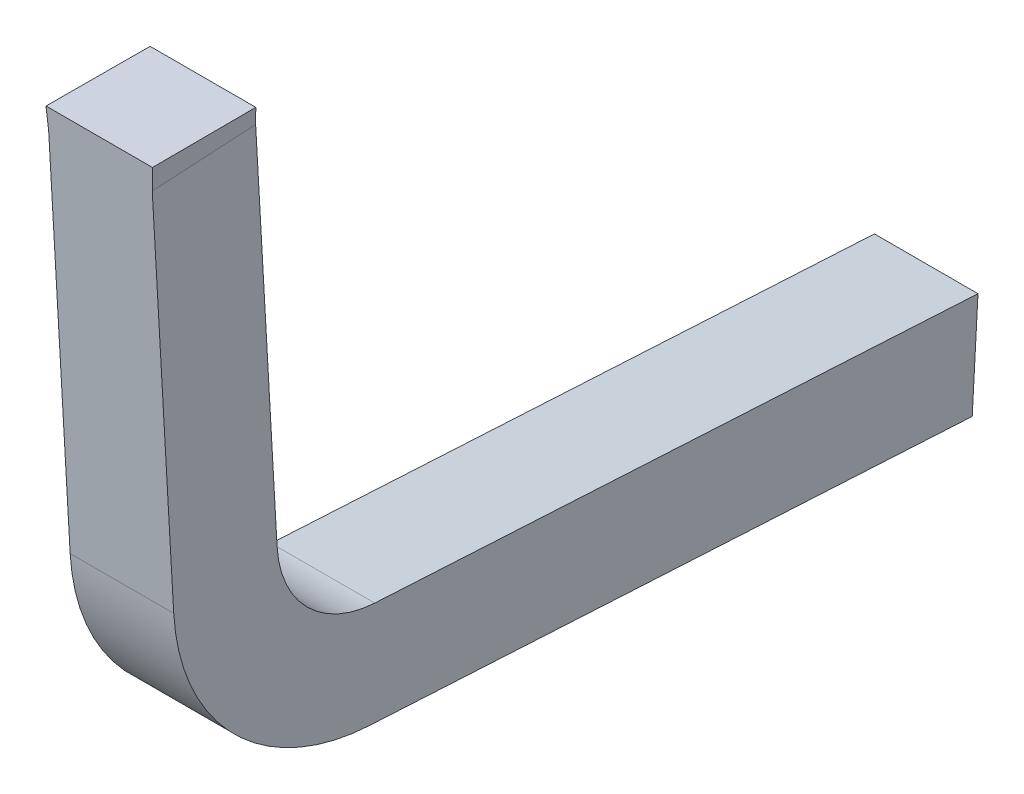
ISO-10303-21;
HEADER;
FILE_DESCRIPTION(('STEP AP214'),'2;1');
FILE_NAME('part.step','',(''),(''),'','','');
FILE_SCHEMA(('AUTOMOTIVE_DESIGN { 1 0 10303 214 1 1 1 1 }'));
ENDSEC;
DATA;
#1=APPLICATION_CONTEXT('core data for automotive mechanical design processes');
#2=APPLICATION_PROTOCOL_DEFINITION('international standard','automotive_design',2000,#1);
#3=PRODUCT_CONTEXT('',#1,'mechanical');
#4=PRODUCT('Part','Part','',(#3));
#5=PRODUCT_RELATED_PRODUCT_CATEGORY('part','',(#4));
#6=PRODUCT_DEFINITION_FORMATION('','',#4);
#7=PRODUCT_DEFINITION_CONTEXT('part definition',#1,'design');
#8=PRODUCT_DEFINITION('design','',#6,#7);
#9=PRODUCT_DEFINITION_SHAPE('','',#8);
#10=(LENGTH_UNIT() NAMED_UNIT(*) SI_UNIT(.MILLI.,.METRE.));
#11=(NAMED_UNIT(*) PLANE_ANGLE_UNIT() SI_UNIT($,.RADIAN.));
#12=(NAMED_UNIT(*) SI_UNIT($,.STERADIAN.) SOLID_ANGLE_UNIT());
#13=UNCERTAINTY_MEASURE_WITH_UNIT(LENGTH_MEASURE(1.E-05),#10,'distance_accuracy_value','');
#14=(GEOMETRIC_REPRESENTATION_CONTEXT(3) GLOBAL_UNCERTAINTY_ASSIGNED_CONTEXT((#13)) GLOBAL_UNIT_ASSIGNED_CONTEXT((#10,
#11,#12)) REPRESENTATION_CONTEXT('',''));
#15=CARTESIAN_POINT('',(0.,0.,0.));
#16=DIRECTION('',(0.,0.,1.));
#17=DIRECTION('',(1.,0.,0.));
#18=AXIS2_PLACEMENT_3D('',#15,#16,#17);
#19=CARTESIAN_POINT('',(-2.601406834182,-2.29897527843,-10.34781984343));
#20=DIRECTION('',(0.997785157857701,0.0664110878974701,0.003787632922693));
#21=DIRECTION('',(-0.0664115642747469,0.997792315129046,0.));
#22=AXIS2_PLACEMENT_3D('',#19,#20,#21);
#23=PLANE('',#22);
#24=DIRECTION('',(0.,-0.0569406083110753,0.998377567418842));
#25=VECTOR('',#24,1.);
#26=CARTESIAN_POINT('',(-2.6,-2.314349492935,-10.44885919008));
#27=LINE('',#26,#25);
#28=CARTESIAN_POINT('',(-2.6,-2.31434949293492,-10.4488591900814));
#29=VERTEX_POINT('',#28);
#30=CARTESIAN_POINT('',(-2.6,-2.32573761459728,-10.2491836765951));
#31=VERTEX_POINT('',#30);
#32=EDGE_CURVE('E98',#29,#31,#27,.T.);
#33=ORIENTED_EDGE('',*,*,#32,.T.);
#34=DIRECTION('',(0.0665190105147783,-0.996166318707982,-0.056814493854309));
#35=VECTOR('',#34,1.);
#36=CARTESIAN_POINT('',(-2.602813668365,-2.28360106392498,-10.2467804967704));
#37=LINE('',#36,#35);
#38=CARTESIAN_POINT('',(-2.602813668365,-2.28360106392499,-10.2467804967704));
#39=VERTEX_POINT('',#38);
#40=EDGE_CURVE('E148',#39,#31,#37,.T.);
#41=ORIENTED_EDGE('',*,*,#40,.F.);
#42=DIRECTION('',(-0.00379601320157547,0.,0.999992795115932));
#43=VECTOR('',#42,1.);
#44=CARTESIAN_POINT('',(-2.602053226489,-2.283601063925,-10.4471055106));
#45=LINE('',#44,#43);
#46=CARTESIAN_POINT('',(-2.602053226489,-2.28360106392489,-10.4471055106019));
#47=VERTEX_POINT('',#46);
#48=EDGE_CURVE('E161',#47,#39,#45,.T.);
#49=ORIENTED_EDGE('',*,*,#48,.F.);
#50=DIRECTION('',(0.0665190105273673,-0.996166318707226,-0.0568144938528306));
#51=VECTOR('',#50,1.);
#52=CARTESIAN_POINT('',(-2.602053226489,-2.28360106392483,-10.4471055106029));
#53=LINE('',#52,#51);
#54=EDGE_CURVE('E103',#47,#29,#53,.T.);
#55=ORIENTED_EDGE('',*,*,#54,.T.);
#56=EDGE_LOOP('',(#33,#41,#49,#55));
#57=FACE_BOUND('',#56,.T.);
#58=ADVANCED_FACE('F17',(#57),#23,.F.);
#59=CARTESIAN_POINT('',(-2.5,-2.283601063925,-10.34694300369));
#60=DIRECTION('',(0.,1.,0.));
#61=DIRECTION('',(0.,0.,1.));
#62=AXIS2_PLACEMENT_3D('',#59,#60,#61);
#63=PLANE('',#62);
#64=DIRECTION('',(1.,0.,0.));
#65=VECTOR('',#64,1.);
#66=CARTESIAN_POINT('',(-2.5,-2.28360106392498,-10.2467804967704));
#67=LINE('',#66,#65);
#68=CARTESIAN_POINT('',(-2.39718633163476,-2.283601063925,-10.2467804967704));
#69=VERTEX_POINT('',#68);
#70=EDGE_CURVE('E154',#69,#39,#67,.F.);
#71=ORIENTED_EDGE('',*,*,#70,.F.);
#72=DIRECTION('',(0.0037960132042621,-1.7968426456006E-13,0.999992795115921));
#73=VECTOR('',#72,1.);
#74=CARTESIAN_POINT('',(-2.3979467735108,-2.28360106392501,-10.4471055106));
#75=LINE('',#74,#73);
#76=CARTESIAN_POINT('',(-2.39794677351087,-2.28360106392495,-10.447105510601));
#77=VERTEX_POINT('',#76);
#78=EDGE_CURVE('E119',#77,#69,#75,.T.);
#79=ORIENTED_EDGE('',*,*,#78,.F.);
#80=DIRECTION('',(1.,0.,0.));
#81=VECTOR('',#80,1.);
#82=CARTESIAN_POINT('',(-2.5,-2.28360106392483,-10.4471055106029));
#83=LINE('',#82,#81);
#84=EDGE_CURVE('E125',#77,#47,#83,.F.);
#85=ORIENTED_EDGE('',*,*,#84,.T.);
#86=ORIENTED_EDGE('',*,*,#48,.T.);
#87=EDGE_LOOP('',(#71,#79,#85,#86));
#88=FACE_BOUND('',#87,.T.);
#89=ADVANCED_FACE('F243',(#88),#63,.T.);
#90=CARTESIAN_POINT('',(-2.6,-2.909472777839,-11.05227927458));
#91=DIRECTION('',(1.,0.,0.));
#92=DIRECTION('',(0.,0.,-1.));
#93=AXIS2_PLACEMENT_3D('',#90,#91,#92);
#94=PLANE('',#93);
#95=CARTESIAN_POINT('',(-2.6,-3.03,-10.69));
#96=DIRECTION('',(-1.,0.,0.));
#97=DIRECTION('',(0.,0.,1.));
#98=AXIS2_PLACEMENT_3D('',#95,#96,#97);
#99=CIRCLE('',#98,0.4);
#100=CARTESIAN_POINT('',(-2.6,-3.05277624331319,-10.2906489730306));
#101=VERTEX_POINT('',#100);
#102=CARTESIAN_POINT('',(-2.6,-3.42937693582933,-10.6676826720305));
#103=VERTEX_POINT('',#102);
#104=EDGE_CURVE('E142',#101,#103,#99,.F.);
#105=ORIENTED_EDGE('',*,*,#104,.F.);
#106=DIRECTION('',(0.,-0.998377567418718,-0.056940608313261));
#107=VECTOR('',#106,1.);
#108=CARTESIAN_POINT('',(-2.6,-2.668188653621,-10.2687147349));
#109=LINE('',#108,#107);
#110=EDGE_CURVE('E145',#31,#101,#109,.T.);
#111=ORIENTED_EDGE('',*,*,#110,.F.);
#112=ORIENTED_EDGE('',*,*,#32,.F.);
#113=DIRECTION('',(0.,-0.998377567418801,-0.0569406083117901));
#114=VECTOR('',#113,1.);
#115=CARTESIAN_POINT('',(-2.6,-2.662494592804,-10.46871499856));
#116=LINE('',#115,#114);
#117=CARTESIAN_POINT('',(-2.6,-3.04138812167726,-10.4903244865168));
#118=VERTEX_POINT('',#117);
#119=EDGE_CURVE('E92',#29,#118,#116,.T.);
#120=ORIENTED_EDGE('',*,*,#119,.T.);
#121=CARTESIAN_POINT('',(-2.6,-3.03,-10.69));
#122=DIRECTION('',(-1.,0.,0.));
#123=DIRECTION('',(0.,0.,1.));
#124=AXIS2_PLACEMENT_3D('',#121,#122,#123);
#125=CIRCLE('',#124,0.2);
#126=CARTESIAN_POINT('',(-2.6,-3.22968846791482,-10.6788413360177));
#127=VERTEX_POINT('',#126);
#128=EDGE_CURVE('E20',#118,#127,#125,.F.);
#129=ORIENTED_EDGE('',*,*,#128,.T.);
#130=DIRECTION('',(0.,0.0557933199228295,0.998442339572991));
#131=VECTOR('',#130,1.);
#132=CARTESIAN_POINT('',(-2.6,-3.262244863925,-11.26145022621));
#133=LINE('',#132,#131);
#134=CARTESIAN_POINT('',(-2.6,-3.29480125993501,-11.8440591164004));
#135=VERTEX_POINT('',#134);
#136=EDGE_CURVE('E111',#135,#127,#133,.T.);
#137=ORIENTED_EDGE('',*,*,#136,.F.);
#138=DIRECTION('',(0.,-0.998442339574031,0.0557933199042218));
#139=VECTOR('',#138,1.);
#140=CARTESIAN_POINT('',(-2.6,-3.394645493892,-11.83847978441));
#141=LINE('',#140,#139);
#142=CARTESIAN_POINT('',(-2.6,-3.49448972784906,-11.8329004524196));
#143=VERTEX_POINT('',#142);
#144=EDGE_CURVE('E135',#135,#143,#141,.T.);
#145=ORIENTED_EDGE('',*,*,#144,.T.);
#146=DIRECTION('',(0.,0.055793319922371,0.998442339573017));
#147=VECTOR('',#146,1.);
#148=CARTESIAN_POINT('',(-2.6,-3.461933331839,-11.25029156222));
#149=LINE('',#148,#147);
#150=EDGE_CURVE('E140',#143,#103,#149,.T.);
#151=ORIENTED_EDGE('',*,*,#150,.T.);
#152=EDGE_LOOP('',(#105,#111,#112,#120,#129,#137,#145,#151));
#153=FACE_BOUND('',#152,.T.);
#154=ADVANCED_FACE('F95',(#153),#94,.F.);
#155=CARTESIAN_POINT('',(-2.5,-3.262244863925,-11.26145022621));
#156=DIRECTION('',(0.,0.998442339572991,-0.0557933199228295));
#157=DIRECTION('',(0.,0.0557933199228295,0.998442339572991));
#158=AXIS2_PLACEMENT_3D('',#155,#156,#157);
#159=PLANE('',#158);
#160=DIRECTION('',(0.,0.055793319922887,0.998442339572988));
#161=VECTOR('',#160,1.);
#162=CARTESIAN_POINT('',(-2.4,-3.294801259935,-11.8440591164));
#163=LINE('',#162,#161);
#164=CARTESIAN_POINT('',(-2.4,-3.29480125993501,-11.8440591164001));
#165=VERTEX_POINT('',#164);
#166=CARTESIAN_POINT('',(-2.4,-3.2296884679148,-10.6788413360177));
#167=VERTEX_POINT('',#166);
#168=EDGE_CURVE('E129',#165,#167,#163,.T.);
#169=ORIENTED_EDGE('',*,*,#168,.F.);
#170=DIRECTION('',(1.,0.,0.));
#171=VECTOR('',#170,1.);
#172=CARTESIAN_POINT('',(-2.5,-3.29480125993502,-11.8440591164004));
#173=LINE('',#172,#171);
#174=EDGE_CURVE('E126',#165,#135,#173,.F.);
#175=ORIENTED_EDGE('',*,*,#174,.T.);
#176=ORIENTED_EDGE('',*,*,#136,.T.);
#177=DIRECTION('',(-1.,0.,0.));
#178=VECTOR('',#177,1.);
#179=CARTESIAN_POINT('',(-2.396,-3.22968846791485,-10.67884133602));
#180=LINE('',#179,#178);
#181=EDGE_CURVE('E110',#127,#167,#180,.F.);
#182=ORIENTED_EDGE('',*,*,#181,.T.);
#183=EDGE_LOOP('',(#169,#175,#176,#182));
#184=FACE_BOUND('',#183,.T.);
#185=ADVANCED_FACE('F234',(#184),#159,.T.);
#186=CARTESIAN_POINT('',(-2.396,-3.03,-10.69));
#187=DIRECTION('',(-1.,0.,0.));
#188=DIRECTION('',(0.,0.,1.));
#189=AXIS2_PLACEMENT_3D('',#186,#187,#188);
#190=CYLINDRICAL_SURFACE('',#189,0.2);
#191=ORIENTED_EDGE('',*,*,#128,.F.);
#192=DIRECTION('',(1.,0.,0.));
#193=VECTOR('',#192,1.);
#194=CARTESIAN_POINT('',(-2.5,-3.04138812169214,-10.4903244865176));
#195=LINE('',#194,#193);
#196=CARTESIAN_POINT('',(-2.4,-3.04138812167779,-10.490324486518));
#197=VERTEX_POINT('',#196);
#198=EDGE_CURVE('E102',#118,#197,#195,.T.);
#199=ORIENTED_EDGE('',*,*,#198,.T.);
#200=CARTESIAN_POINT('',(-2.4,-3.03,-10.69));
#201=DIRECTION('',(-1.,0.,0.));
#202=DIRECTION('',(0.,0.,1.));
#203=AXIS2_PLACEMENT_3D('',#200,#201,#202);
#204=CIRCLE('',#203,0.2);
#205=EDGE_CURVE('E185',#167,#197,#204,.T.);
#206=ORIENTED_EDGE('',*,*,#205,.F.);
#207=ORIENTED_EDGE('',*,*,#181,.F.);
#208=EDGE_LOOP('',(#191,#199,#206,#207));
#209=FACE_BOUND('',#208,.T.);
#210=ADVANCED_FACE('F107',(#209),#190,.F.);
#211=CARTESIAN_POINT('',(-2.5,-2.662494592804,-10.46871499856));
#212=DIRECTION('',(0.,-0.0569406083117901,0.998377567418801));
#213=DIRECTION('',(0.,-0.998377567418801,-0.0569406083117901));
#214=AXIS2_PLACEMENT_3D('',#211,#212,#213);
#215=PLANE('',#214);
#216=DIRECTION('',(0.,0.998377567418456,0.0569406083178453));
#217=VECTOR('',#216,1.);
#218=CARTESIAN_POINT('',(-2.4,-3.041388121692,-10.49032448652));
#219=LINE('',#218,#217);
#220=CARTESIAN_POINT('',(-2.39999999999992,-2.314349492934,-10.44885919008));
#221=VERTEX_POINT('',#220);
#222=EDGE_CURVE('E114',#197,#221,#219,.T.);
#223=ORIENTED_EDGE('',*,*,#222,.F.);
#224=ORIENTED_EDGE('',*,*,#198,.F.);
#225=ORIENTED_EDGE('',*,*,#119,.F.);
#226=ORIENTED_EDGE('',*,*,#54,.F.);
#227=ORIENTED_EDGE('',*,*,#84,.F.);
#228=DIRECTION('',(0.0665190105284185,0.996166318705548,0.0568144938810224));
#229=VECTOR('',#228,1.);
#230=CARTESIAN_POINT('',(-2.39999999999977,-2.31434949293401,-10.44885919008));
#231=LINE('',#230,#229);
#232=EDGE_CURVE('E116',#221,#77,#231,.T.);
#233=ORIENTED_EDGE('',*,*,#232,.F.);
#234=EDGE_LOOP('',(#223,#224,#225,#226,#227,#233));
#235=FACE_BOUND('',#234,.T.);
#236=ADVANCED_FACE('F112',(#235),#215,.F.);
#237=CARTESIAN_POINT('',(-2.398593165817,-2.298975278429,-10.34781984343));
#238=DIRECTION('',(0.9977851578563,-0.06641108791847,-0.003787632923708));
#239=DIRECTION('',(0.0664115642957472,0.997792315127648,0.));
#240=AXIS2_PLACEMENT_3D('',#237,#238,#239);
#241=PLANE('',#240);
#242=ORIENTED_EDGE('',*,*,#232,.T.);
#243=ORIENTED_EDGE('',*,*,#78,.T.);
#244=DIRECTION('',(0.0665190105179116,0.996166318707773,0.0568144938543194));
#245=VECTOR('',#244,1.);
#246=CARTESIAN_POINT('',(-2.4,-2.32573761459528,-10.249183676595));
#247=LINE('',#246,#245);
#248=CARTESIAN_POINT('',(-2.4,-2.32573761459509,-10.2491836765983));
#249=VERTEX_POINT('',#248);
#250=EDGE_CURVE('E147',#249,#69,#247,.T.);
#251=ORIENTED_EDGE('',*,*,#250,.F.);
#252=DIRECTION('',(0.,-0.0569406083060912,0.998377567419126));
#253=VECTOR('',#252,1.);
#254=CARTESIAN_POINT('',(-2.4,-2.314349492934,-10.44885919008));
#255=LINE('',#254,#253);
#256=EDGE_CURVE('E200',#221,#249,#255,.T.);
#257=ORIENTED_EDGE('',*,*,#256,.F.);
#258=EDGE_LOOP('',(#242,#243,#251,#257));
#259=FACE_BOUND('',#258,.T.);
#260=ADVANCED_FACE('F258',(#259),#241,.T.);
#261=CARTESIAN_POINT('',(-2.5,-2.668188653621,-10.2687147349));
#262=DIRECTION('',(0.,-0.056940608313261,0.998377567418718));
#263=DIRECTION('',(0.,-0.998377567418718,-0.056940608313261));
#264=AXIS2_PLACEMENT_3D('',#261,#262,#263);
#265=PLANE('',#264);
#266=ORIENTED_EDGE('',*,*,#250,.T.);
#267=ORIENTED_EDGE('',*,*,#70,.T.);
#268=ORIENTED_EDGE('',*,*,#40,.T.);
#269=ORIENTED_EDGE('',*,*,#110,.T.);
#270=DIRECTION('',(-1.,0.,0.));
#271=VECTOR('',#270,1.);
#272=CARTESIAN_POINT('',(-2.396,-3.05277624330094,-10.2906489730311));
#273=LINE('',#272,#271);
#274=CARTESIAN_POINT('',(-2.4,-3.05277624331214,-10.2906489730312));
#275=VERTEX_POINT('',#274);
#276=EDGE_CURVE('E157',#275,#101,#273,.T.);
#277=ORIENTED_EDGE('',*,*,#276,.F.);
#278=DIRECTION('',(0.,-0.998377567419005,-0.0569406083082185));
#279=VECTOR('',#278,1.);
#280=CARTESIAN_POINT('',(-2.4,-2.325737614595,-10.2491836766));
#281=LINE('',#280,#279);
#282=EDGE_CURVE('E184',#249,#275,#281,.T.);
#283=ORIENTED_EDGE('',*,*,#282,.F.);
#284=EDGE_LOOP('',(#266,#267,#268,#269,#277,#283));
#285=FACE_BOUND('',#284,.T.);
#286=ADVANCED_FACE('F227',(#285),#265,.T.);
#287=CARTESIAN_POINT('',(-2.396,-3.03,-10.69));
#288=DIRECTION('',(-1.,0.,0.));
#289=DIRECTION('',(0.,0.,1.));
#290=AXIS2_PLACEMENT_3D('',#287,#288,#289);
#291=CYLINDRICAL_SURFACE('',#290,0.4);
#292=DIRECTION('',(1.,0.,0.));
#293=VECTOR('',#292,1.);
#294=CARTESIAN_POINT('',(-2.5,-3.4293769358293,-10.66768267203));
#295=LINE('',#294,#293);
#296=CARTESIAN_POINT('',(-2.4,-3.42937693582946,-10.6676826720306));
#297=VERTEX_POINT('',#296);
#298=EDGE_CURVE('E137',#103,#297,#295,.T.);
#299=ORIENTED_EDGE('',*,*,#298,.T.);
#300=CARTESIAN_POINT('',(-2.4,-3.03,-10.69));
#301=DIRECTION('',(-1.,0.,0.));
#302=DIRECTION('',(0.,0.,1.));
#303=AXIS2_PLACEMENT_3D('',#300,#301,#302);
#304=CIRCLE('',#303,0.4);
#305=EDGE_CURVE('E181',#275,#297,#304,.F.);
#306=ORIENTED_EDGE('',*,*,#305,.F.);
#307=ORIENTED_EDGE('',*,*,#276,.T.);
#308=ORIENTED_EDGE('',*,*,#104,.T.);
#309=EDGE_LOOP('',(#299,#306,#307,#308));
#310=FACE_BOUND('',#309,.T.);
#311=ADVANCED_FACE('F220',(#310),#291,.T.);
#312=CARTESIAN_POINT('',(-2.5,-3.461933331839,-11.25029156222));
#313=DIRECTION('',(0.,0.998442339573017,-0.055793319922371));
#314=DIRECTION('',(0.,0.055793319922371,0.998442339573017));
#315=AXIS2_PLACEMENT_3D('',#312,#313,#314);
#316=PLANE('',#315);
#317=ORIENTED_EDGE('',*,*,#298,.F.);
#318=ORIENTED_EDGE('',*,*,#150,.F.);
#319=DIRECTION('',(1.,0.,0.));
#320=VECTOR('',#319,1.);
#321=CARTESIAN_POINT('',(-2.5,-3.49448972784898,-11.8329004524196));
#322=LINE('',#321,#320);
#323=CARTESIAN_POINT('',(-2.4,-3.49448972784899,-11.8329004524199));
#324=VERTEX_POINT('',#323);
#325=EDGE_CURVE('E35',#143,#324,#322,.T.);
#326=ORIENTED_EDGE('',*,*,#325,.T.);
#327=DIRECTION('',(0.,-0.0557933199219327,-0.998442339573042));
#328=VECTOR('',#327,1.);
#329=CARTESIAN_POINT('',(-2.4,-3.429376935829,-10.66768267202));
#330=LINE('',#329,#328);
#331=EDGE_CURVE('E26',#297,#324,#330,.T.);
#332=ORIENTED_EDGE('',*,*,#331,.F.);
#333=EDGE_LOOP('',(#317,#318,#326,#332));
#334=FACE_BOUND('',#333,.T.);
#335=ADVANCED_FACE('F222',(#334),#316,.F.);
#336=CARTESIAN_POINT('',(-2.5,-3.394645493892,-11.83847978441));
#337=DIRECTION('',(0.,0.0557933199042218,0.998442339574031));
#338=DIRECTION('',(0.,-0.998442339574031,0.0557933199042218));
#339=AXIS2_PLACEMENT_3D('',#336,#337,#338);
#340=PLANE('',#339);
#341=DIRECTION('',(0.,0.998442339574254,-0.0557933199002383));
#342=VECTOR('',#341,1.);
#343=CARTESIAN_POINT('',(-2.4,-3.494489727849,-11.83290045242));
#344=LINE('',#343,#342);
#345=EDGE_CURVE('E11',#324,#165,#344,.T.);
#346=ORIENTED_EDGE('',*,*,#345,.F.);
#347=ORIENTED_EDGE('',*,*,#325,.F.);
#348=ORIENTED_EDGE('',*,*,#144,.F.);
#349=ORIENTED_EDGE('',*,*,#174,.F.);
#350=EDGE_LOOP('',(#346,#347,#348,#349));
#351=FACE_BOUND('',#350,.T.);
#352=ADVANCED_FACE('F230',(#351),#340,.F.);
#353=CARTESIAN_POINT('',(-2.4,-2.909472777838,-11.05227927458));
#354=DIRECTION('',(1.,0.,0.));
#355=DIRECTION('',(0.,0.,-1.));
#356=AXIS2_PLACEMENT_3D('',#353,#354,#355);
#357=PLANE('',#356);
#358=ORIENTED_EDGE('',*,*,#331,.T.);
#359=ORIENTED_EDGE('',*,*,#345,.T.);
#360=ORIENTED_EDGE('',*,*,#168,.T.);
#361=ORIENTED_EDGE('',*,*,#205,.T.);
#362=ORIENTED_EDGE('',*,*,#222,.T.);
#363=ORIENTED_EDGE('',*,*,#256,.T.);
#364=ORIENTED_EDGE('',*,*,#282,.T.);
#365=ORIENTED_EDGE('',*,*,#305,.T.);
#366=EDGE_LOOP('',(#358,#359,#360,#361,#362,#363,#364,#365));
#367=FACE_BOUND('',#366,.T.);
#368=ADVANCED_FACE('F224',(#367),#357,.T.);
#369=CLOSED_SHELL('',(#58,#89,#154,#185,#210,#236,#260,#286,#311,#335,#352,#368));
#370=MANIFOLD_SOLID_BREP('B1',#369);
#371=ADVANCED_BREP_SHAPE_REPRESENTATION('',(#18,#370),#14);
#372=SHAPE_DEFINITION_REPRESENTATION(#9,#371);
ENDSEC;
END-ISO-10303-21;
